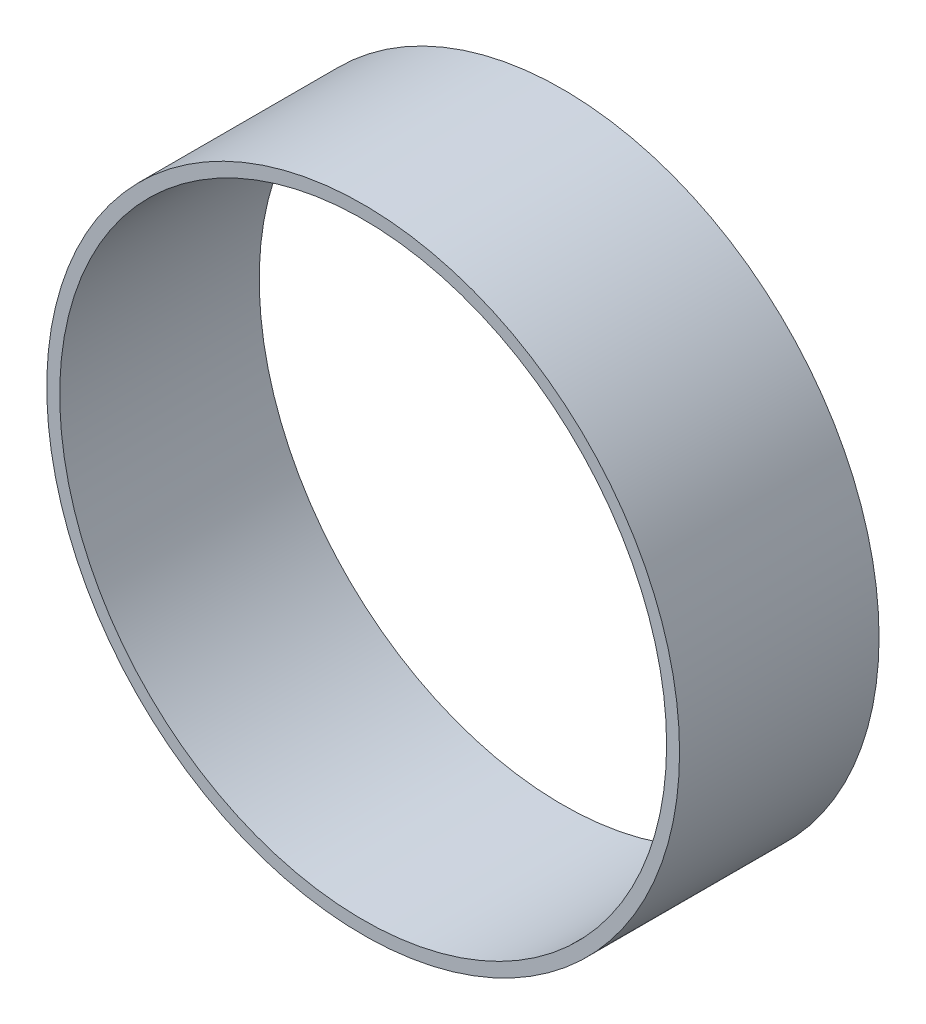
ISO-10303-21;
HEADER;
FILE_DESCRIPTION(('STEP AP214'),'2;1');
FILE_NAME('part.step','',(''),(''),'','','');
FILE_SCHEMA(('AUTOMOTIVE_DESIGN { 1 0 10303 214 1 1 1 1 }'));
ENDSEC;
DATA;
#1=APPLICATION_CONTEXT('core data for automotive mechanical design processes');
#2=APPLICATION_PROTOCOL_DEFINITION('international standard','automotive_design',2000,#1);
#3=PRODUCT_CONTEXT('',#1,'mechanical');
#4=PRODUCT('Part','Part','',(#3));
#5=PRODUCT_RELATED_PRODUCT_CATEGORY('part','',(#4));
#6=PRODUCT_DEFINITION_FORMATION('','',#4);
#7=PRODUCT_DEFINITION_CONTEXT('part definition',#1,'design');
#8=PRODUCT_DEFINITION('design','',#6,#7);
#9=PRODUCT_DEFINITION_SHAPE('','',#8);
#10=(LENGTH_UNIT() NAMED_UNIT(*) SI_UNIT(.MILLI.,.METRE.));
#11=(NAMED_UNIT(*) PLANE_ANGLE_UNIT() SI_UNIT($,.RADIAN.));
#12=(NAMED_UNIT(*) SI_UNIT($,.STERADIAN.) SOLID_ANGLE_UNIT());
#13=UNCERTAINTY_MEASURE_WITH_UNIT(LENGTH_MEASURE(1.E-05),#10,'distance_accuracy_value','');
#14=(GEOMETRIC_REPRESENTATION_CONTEXT(3) GLOBAL_UNCERTAINTY_ASSIGNED_CONTEXT((#13)) GLOBAL_UNIT_ASSIGNED_CONTEXT((#10,
#11,#12)) REPRESENTATION_CONTEXT('',''));
#15=CARTESIAN_POINT('',(0.,0.,0.));
#16=DIRECTION('',(0.,0.,1.));
#17=DIRECTION('',(1.,0.,0.));
#18=AXIS2_PLACEMENT_3D('',#15,#16,#17);
#19=CARTESIAN_POINT('',(0.,0.,0.));
#20=DIRECTION('',(0.,0.,-1.));
#21=DIRECTION('',(1.,0.,0.));
#22=AXIS2_PLACEMENT_3D('',#19,#20,#21);
#23=CYLINDRICAL_SURFACE('',#22,0.62040008);
#24=CARTESIAN_POINT('',(0.,0.,0.39116));
#25=DIRECTION('',(0.,0.,1.));
#26=DIRECTION('',(1.,0.,0.));
#27=AXIS2_PLACEMENT_3D('',#24,#25,#26);
#28=CIRCLE('',#27,0.62040008);
#29=CARTESIAN_POINT('',(0.62040008,0.,0.39116));
#30=VERTEX_POINT('',#29);
#31=EDGE_CURVE('E11',#30,#30,#28,.T.);
#32=ORIENTED_EDGE('',*,*,#31,.F.);
#33=DIRECTION('',(0.,0.,1.));
#34=VECTOR('',#33,1.);
#35=CARTESIAN_POINT('',(0.62040008,0.,0.));
#36=LINE('',#35,#34);
#37=CARTESIAN_POINT('',(0.62040008,0.,0.));
#38=VERTEX_POINT('',#37);
#39=EDGE_CURVE('E24',#38,#30,#36,.T.);
#40=ORIENTED_EDGE('',*,*,#39,.F.);
#41=CARTESIAN_POINT('',(0.,0.,0.));
#42=DIRECTION('',(0.,0.,1.));
#43=DIRECTION('',(1.,0.,0.));
#44=AXIS2_PLACEMENT_3D('',#41,#42,#43);
#45=CIRCLE('',#44,0.62040008);
#46=EDGE_CURVE('E46',#38,#38,#45,.T.);
#47=ORIENTED_EDGE('',*,*,#46,.T.);
#48=ORIENTED_EDGE('',*,*,#39,.T.);
#49=EDGE_LOOP('',(#32,#40,#47,#48));
#50=FACE_BOUND('',#49,.T.);
#51=ADVANCED_FACE('F17',(#50),#23,.T.);
#52=CARTESIAN_POINT('',(0.,0.,0.));
#53=DIRECTION('',(0.,0.,-1.));
#54=DIRECTION('',(1.,0.,0.));
#55=AXIS2_PLACEMENT_3D('',#52,#53,#54);
#56=CYLINDRICAL_SURFACE('',#55,0.59500008);
#57=DIRECTION('',(0.,0.,1.));
#58=VECTOR('',#57,1.);
#59=CARTESIAN_POINT('',(0.59500008,0.,0.));
#60=LINE('',#59,#58);
#61=CARTESIAN_POINT('',(0.59500008,0.,0.));
#62=VERTEX_POINT('',#61);
#63=CARTESIAN_POINT('',(0.59500008,0.,0.39116));
#64=VERTEX_POINT('',#63);
#65=EDGE_CURVE('E40',#62,#64,#60,.T.);
#66=ORIENTED_EDGE('',*,*,#65,.T.);
#67=CARTESIAN_POINT('',(0.,0.,0.39116));
#68=DIRECTION('',(0.,0.,1.));
#69=DIRECTION('',(1.,0.,0.));
#70=AXIS2_PLACEMENT_3D('',#67,#68,#69);
#71=CIRCLE('',#70,0.59500008);
#72=EDGE_CURVE('E45',#64,#64,#71,.T.);
#73=ORIENTED_EDGE('',*,*,#72,.T.);
#74=ORIENTED_EDGE('',*,*,#65,.F.);
#75=CARTESIAN_POINT('',(0.,0.,0.));
#76=DIRECTION('',(0.,0.,1.));
#77=DIRECTION('',(1.,0.,0.));
#78=AXIS2_PLACEMENT_3D('',#75,#76,#77);
#79=CIRCLE('',#78,0.59500008);
#80=EDGE_CURVE('E43',#62,#62,#79,.T.);
#81=ORIENTED_EDGE('',*,*,#80,.F.);
#82=EDGE_LOOP('',(#66,#73,#74,#81));
#83=FACE_BOUND('',#82,.T.);
#84=ADVANCED_FACE('F42',(#83),#56,.F.);
#85=CARTESIAN_POINT('',(0.62040008,0.,0.));
#86=DIRECTION('',(0.,0.,-1.));
#87=DIRECTION('',(-1.,0.,0.));
#88=AXIS2_PLACEMENT_3D('',#85,#86,#87);
#89=PLANE('',#88);
#90=ORIENTED_EDGE('',*,*,#46,.F.);
#91=EDGE_LOOP('',(#90));
#92=FACE_BOUND('',#91,.T.);
#93=ORIENTED_EDGE('',*,*,#80,.T.);
#94=EDGE_LOOP('',(#93));
#95=FACE_BOUND('',#94,.T.);
#96=ADVANCED_FACE('F49',(#92,#95),#89,.T.);
#97=CARTESIAN_POINT('',(0.62040008,0.,0.39116));
#98=DIRECTION('',(0.,0.,-1.));
#99=DIRECTION('',(-1.,0.,0.));
#100=AXIS2_PLACEMENT_3D('',#97,#98,#99);
#101=PLANE('',#100);
#102=ORIENTED_EDGE('',*,*,#31,.T.);
#103=EDGE_LOOP('',(#102));
#104=FACE_BOUND('',#103,.T.);
#105=ORIENTED_EDGE('',*,*,#72,.F.);
#106=EDGE_LOOP('',(#105));
#107=FACE_BOUND('',#106,.T.);
#108=ADVANCED_FACE('F56',(#104,#107),#101,.F.);
#109=CLOSED_SHELL('',(#51,#84,#96,#108));
#110=MANIFOLD_SOLID_BREP('B1',#109);
#111=ADVANCED_BREP_SHAPE_REPRESENTATION('',(#18,#110),#14);
#112=SHAPE_DEFINITION_REPRESENTATION(#9,#111);
ENDSEC;
END-ISO-10303-21;
